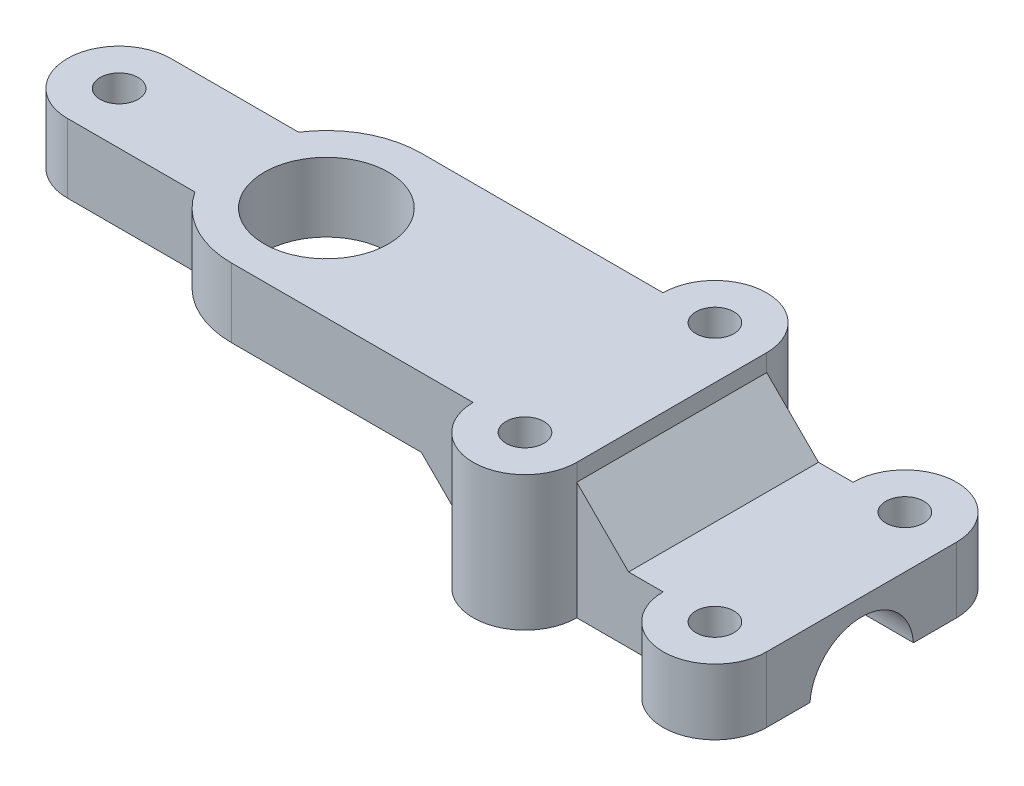
ISO-10303-21;
HEADER;
FILE_DESCRIPTION(('STEP AP214'),'2;1');
FILE_NAME('part.step','',(''),(''),'','','');
FILE_SCHEMA(('AUTOMOTIVE_DESIGN { 1 0 10303 214 1 1 1 1 }'));
ENDSEC;
DATA;
#1=APPLICATION_CONTEXT('core data for automotive mechanical design processes');
#2=APPLICATION_PROTOCOL_DEFINITION('international standard','automotive_design',2000,#1);
#3=PRODUCT_CONTEXT('',#1,'mechanical');
#4=PRODUCT('Part','Part','',(#3));
#5=PRODUCT_RELATED_PRODUCT_CATEGORY('part','',(#4));
#6=PRODUCT_DEFINITION_FORMATION('','',#4);
#7=PRODUCT_DEFINITION_CONTEXT('part definition',#1,'design');
#8=PRODUCT_DEFINITION('design','',#6,#7);
#9=PRODUCT_DEFINITION_SHAPE('','',#8);
#10=(LENGTH_UNIT() NAMED_UNIT(*) SI_UNIT(.MILLI.,.METRE.));
#11=(NAMED_UNIT(*) PLANE_ANGLE_UNIT() SI_UNIT($,.RADIAN.));
#12=(NAMED_UNIT(*) SI_UNIT($,.STERADIAN.) SOLID_ANGLE_UNIT());
#13=UNCERTAINTY_MEASURE_WITH_UNIT(LENGTH_MEASURE(1.E-05),#10,'distance_accuracy_value','');
#14=(GEOMETRIC_REPRESENTATION_CONTEXT(3) GLOBAL_UNCERTAINTY_ASSIGNED_CONTEXT((#13)) GLOBAL_UNIT_ASSIGNED_CONTEXT((#10,
#11,#12)) REPRESENTATION_CONTEXT('',''));
#15=CARTESIAN_POINT('',(0.,0.,0.));
#16=DIRECTION('',(0.,0.,1.));
#17=DIRECTION('',(1.,0.,0.));
#18=AXIS2_PLACEMENT_3D('',#15,#16,#17);
#19=CARTESIAN_POINT('',(26.,-4.,0.));
#20=DIRECTION('',(1.,0.,0.));
#21=DIRECTION('',(0.,0.,-1.));
#22=AXIS2_PLACEMENT_3D('',#19,#20,#21);
#23=PLANE('',#22);
#24=DIRECTION('',(0.,0.,-1.));
#25=VECTOR('',#24,1.);
#26=CARTESIAN_POINT('',(26.,-3.8,-0.974165738677395));
#27=LINE('',#26,#25);
#28=CARTESIAN_POINT('',(26.,-3.8,-1.));
#29=VERTEX_POINT('',#28);
#30=CARTESIAN_POINT('',(26.,-3.8,-5.5));
#31=VERTEX_POINT('',#30);
#32=EDGE_CURVE('E219',#29,#31,#27,.T.);
#33=ORIENTED_EDGE('',*,*,#32,.F.);
#34=DIRECTION('',(0.,-0.707106781186551,-0.707106781186544));
#35=VECTOR('',#34,1.);
#36=CARTESIAN_POINT('',(26.,-3.77416573867739,-0.974165738677395));
#37=LINE('',#36,#35);
#38=CARTESIAN_POINT('',(26.,-3.77416573867739,-0.974165738677395));
#39=VERTEX_POINT('',#38);
#40=EDGE_CURVE('E377',#29,#39,#37,.F.);
#41=ORIENTED_EDGE('',*,*,#40,.T.);
#42=CARTESIAN_POINT('',(26.,-4.,0.));
#43=DIRECTION('',(1.,0.,0.));
#44=DIRECTION('',(0.,0.,-1.));
#45=AXIS2_PLACEMENT_3D('',#42,#43,#44);
#46=CIRCLE('',#45,1.);
#47=CARTESIAN_POINT('',(26.,-3.,0.));
#48=VERTEX_POINT('',#47);
#49=EDGE_CURVE('E414',#39,#48,#46,.T.);
#50=ORIENTED_EDGE('',*,*,#49,.T.);
#51=DIRECTION('',(0.,0.,-1.));
#52=VECTOR('',#51,1.);
#53=CARTESIAN_POINT('',(26.,-3.00000000000001,-5.5));
#54=LINE('',#53,#52);
#55=CARTESIAN_POINT('',(26.,-3.00000000000001,-5.5));
#56=VERTEX_POINT('',#55);
#57=EDGE_CURVE('E243',#48,#56,#54,.T.);
#58=ORIENTED_EDGE('',*,*,#57,.T.);
#59=DIRECTION('',(0.,1.,0.));
#60=VECTOR('',#59,1.);
#61=CARTESIAN_POINT('',(26.,-4.,-5.5));
#62=LINE('',#61,#60);
#63=EDGE_CURVE('E236',#31,#56,#62,.T.);
#64=ORIENTED_EDGE('',*,*,#63,.F.);
#65=EDGE_LOOP('',(#33,#41,#50,#58,#64));
#66=FACE_BOUND('',#65,.T.);
#67=ADVANCED_FACE('F45',(#66),#23,.F.);
#68=CARTESIAN_POINT('',(29.,4.,5.5));
#69=DIRECTION('',(0.,-1.,0.));
#70=DIRECTION('',(0.,0.,-1.));
#71=AXIS2_PLACEMENT_3D('',#68,#69,#70);
#72=CYLINDRICAL_SURFACE('',#71,2.99999999999999);
#73=DIRECTION('',(0.,1.,0.));
#74=VECTOR('',#73,1.);
#75=CARTESIAN_POINT('',(26.,-4.,5.5));
#76=LINE('',#75,#74);
#77=CARTESIAN_POINT('',(26.,-3.8,5.5));
#78=VERTEX_POINT('',#77);
#79=CARTESIAN_POINT('',(26.,-3.00000000000001,5.5));
#80=VERTEX_POINT('',#79);
#81=EDGE_CURVE('E245',#78,#80,#76,.T.);
#82=ORIENTED_EDGE('',*,*,#81,.F.);
#83=CARTESIAN_POINT('',(29.,-3.8,5.5));
#84=DIRECTION('',(0.,-1.,0.));
#85=DIRECTION('',(0.,0.,-1.));
#86=AXIS2_PLACEMENT_3D('',#83,#84,#85);
#87=CIRCLE('',#86,2.99999999999999);
#88=CARTESIAN_POINT('',(32.,-3.8,5.5));
#89=VERTEX_POINT('',#88);
#90=EDGE_CURVE('E230',#89,#78,#87,.T.);
#91=ORIENTED_EDGE('',*,*,#90,.F.);
#92=DIRECTION('',(0.,1.,0.));
#93=VECTOR('',#92,1.);
#94=CARTESIAN_POINT('',(32.,-4.,5.5));
#95=LINE('',#94,#93);
#96=CARTESIAN_POINT('',(32.,2.99999999999998,5.5));
#97=VERTEX_POINT('',#96);
#98=EDGE_CURVE('E247',#89,#97,#95,.T.);
#99=ORIENTED_EDGE('',*,*,#98,.T.);
#100=DIRECTION('',(0.,-1.,0.));
#101=VECTOR('',#100,1.);
#102=CARTESIAN_POINT('',(32.,4.,5.5));
#103=LINE('',#102,#101);
#104=CARTESIAN_POINT('',(32.,4.,5.5));
#105=VERTEX_POINT('',#104);
#106=EDGE_CURVE('E327',#105,#97,#103,.T.);
#107=ORIENTED_EDGE('',*,*,#106,.F.);
#108=CARTESIAN_POINT('',(29.,4.,5.5));
#109=DIRECTION('',(0.,1.,0.));
#110=DIRECTION('',(0.,0.,1.));
#111=AXIS2_PLACEMENT_3D('',#108,#109,#110);
#112=CIRCLE('',#111,2.99999999999999);
#113=CARTESIAN_POINT('',(26.,4.,5.5));
#114=VERTEX_POINT('',#113);
#115=EDGE_CURVE('E279',#105,#114,#112,.F.);
#116=ORIENTED_EDGE('',*,*,#115,.T.);
#117=DIRECTION('',(0.,-1.,0.));
#118=VECTOR('',#117,1.);
#119=CARTESIAN_POINT('',(26.,4.,5.5));
#120=LINE('',#119,#118);
#121=EDGE_CURVE('E330',#114,#80,#120,.T.);
#122=ORIENTED_EDGE('',*,*,#121,.T.);
#123=EDGE_LOOP('',(#82,#91,#99,#107,#116,#122));
#124=FACE_BOUND('',#123,.T.);
#125=ADVANCED_FACE('F512',(#124),#72,.T.);
#126=CARTESIAN_POINT('',(29.,4.,-5.5));
#127=DIRECTION('',(0.,-1.,0.));
#128=DIRECTION('',(0.,0.,-1.));
#129=AXIS2_PLACEMENT_3D('',#126,#127,#128);
#130=CYLINDRICAL_SURFACE('',#129,2.99999999999999);
#131=CARTESIAN_POINT('',(29.,-3.8,-5.5));
#132=DIRECTION('',(0.,-1.,0.));
#133=DIRECTION('',(0.,0.,-1.));
#134=AXIS2_PLACEMENT_3D('',#131,#132,#133);
#135=CIRCLE('',#134,3.);
#136=CARTESIAN_POINT('',(32.,-3.8,-5.5));
#137=VERTEX_POINT('',#136);
#138=EDGE_CURVE('E223',#31,#137,#135,.T.);
#139=ORIENTED_EDGE('',*,*,#138,.F.);
#140=ORIENTED_EDGE('',*,*,#63,.T.);
#141=DIRECTION('',(0.,-1.,0.));
#142=VECTOR('',#141,1.);
#143=CARTESIAN_POINT('',(26.,4.,-5.5));
#144=LINE('',#143,#142);
#145=CARTESIAN_POINT('',(26.,4.,-5.5));
#146=VERTEX_POINT('',#145);
#147=EDGE_CURVE('E323',#146,#56,#144,.T.);
#148=ORIENTED_EDGE('',*,*,#147,.F.);
#149=CARTESIAN_POINT('',(29.,4.,-5.5));
#150=DIRECTION('',(0.,1.,0.));
#151=DIRECTION('',(0.,0.,1.));
#152=AXIS2_PLACEMENT_3D('',#149,#150,#151);
#153=CIRCLE('',#152,2.99999999999999);
#154=CARTESIAN_POINT('',(32.,4.,-5.5));
#155=VERTEX_POINT('',#154);
#156=EDGE_CURVE('E285',#155,#146,#153,.T.);
#157=ORIENTED_EDGE('',*,*,#156,.F.);
#158=DIRECTION('',(0.,-1.,0.));
#159=VECTOR('',#158,1.);
#160=CARTESIAN_POINT('',(32.,4.,-5.5));
#161=LINE('',#160,#159);
#162=CARTESIAN_POINT('',(32.,2.99999999999998,-5.5));
#163=VERTEX_POINT('',#162);
#164=EDGE_CURVE('E325',#155,#163,#161,.T.);
#165=ORIENTED_EDGE('',*,*,#164,.T.);
#166=DIRECTION('',(0.,1.,0.));
#167=VECTOR('',#166,1.);
#168=CARTESIAN_POINT('',(32.,-4.,-5.5));
#169=LINE('',#168,#167);
#170=EDGE_CURVE('E239',#137,#163,#169,.T.);
#171=ORIENTED_EDGE('',*,*,#170,.F.);
#172=EDGE_LOOP('',(#139,#140,#148,#157,#165,#171));
#173=FACE_BOUND('',#172,.T.);
#174=ADVANCED_FACE('F234',(#173),#130,.T.);
#175=CARTESIAN_POINT('',(29.,4.,-5.5));
#176=DIRECTION('',(0.,-1.,0.));
#177=DIRECTION('',(0.,0.,-1.));
#178=AXIS2_PLACEMENT_3D('',#175,#176,#177);
#179=CYLINDRICAL_SURFACE('',#178,1.1);
#180=CARTESIAN_POINT('',(29.,4.,-5.5));
#181=DIRECTION('',(0.,1.,0.));
#182=DIRECTION('',(0.,0.,1.));
#183=AXIS2_PLACEMENT_3D('',#180,#181,#182);
#184=CIRCLE('',#183,1.1);
#185=CARTESIAN_POINT('',(29.,4.,-4.4));
#186=VERTEX_POINT('',#185);
#187=EDGE_CURVE('E262',#186,#186,#184,.T.);
#188=ORIENTED_EDGE('',*,*,#187,.T.);
#189=EDGE_LOOP('',(#188));
#190=FACE_BOUND('',#189,.T.);
#191=CARTESIAN_POINT('',(29.,-3.8,-5.5));
#192=DIRECTION('',(0.,-1.,0.));
#193=DIRECTION('',(0.,0.,-1.));
#194=AXIS2_PLACEMENT_3D('',#191,#192,#193);
#195=CIRCLE('',#194,1.1);
#196=CARTESIAN_POINT('',(29.,-3.8,-6.6));
#197=VERTEX_POINT('',#196);
#198=EDGE_CURVE('E487',#197,#197,#195,.T.);
#199=ORIENTED_EDGE('',*,*,#198,.T.);
#200=EDGE_LOOP('',(#199));
#201=FACE_BOUND('',#200,.T.);
#202=ADVANCED_FACE('F612',(#190,#201),#179,.F.);
#203=CARTESIAN_POINT('',(29.,4.,5.5));
#204=DIRECTION('',(0.,-1.,0.));
#205=DIRECTION('',(0.,0.,-1.));
#206=AXIS2_PLACEMENT_3D('',#203,#204,#205);
#207=CYLINDRICAL_SURFACE('',#206,1.1);
#208=CARTESIAN_POINT('',(29.,4.,5.5));
#209=DIRECTION('',(0.,1.,0.));
#210=DIRECTION('',(0.,0.,1.));
#211=AXIS2_PLACEMENT_3D('',#208,#209,#210);
#212=CIRCLE('',#211,1.1);
#213=CARTESIAN_POINT('',(29.,4.,6.6));
#214=VERTEX_POINT('',#213);
#215=EDGE_CURVE('E259',#214,#214,#212,.F.);
#216=ORIENTED_EDGE('',*,*,#215,.F.);
#217=EDGE_LOOP('',(#216));
#218=FACE_BOUND('',#217,.T.);
#219=CARTESIAN_POINT('',(29.,-3.8,5.5));
#220=DIRECTION('',(0.,-1.,0.));
#221=DIRECTION('',(0.,0.,-1.));
#222=AXIS2_PLACEMENT_3D('',#219,#220,#221);
#223=CIRCLE('',#222,1.1);
#224=CARTESIAN_POINT('',(29.,-3.8,4.4));
#225=VERTEX_POINT('',#224);
#226=EDGE_CURVE('E478',#225,#225,#223,.F.);
#227=ORIENTED_EDGE('',*,*,#226,.F.);
#228=EDGE_LOOP('',(#227));
#229=FACE_BOUND('',#228,.T.);
#230=ADVANCED_FACE('F586',(#218,#229),#207,.F.);
#231=CARTESIAN_POINT('',(43.,-4.,0.));
#232=DIRECTION('',(-1.,0.,0.));
#233=DIRECTION('',(0.,0.,1.));
#234=AXIS2_PLACEMENT_3D('',#231,#232,#233);
#235=PLANE('',#234);
#236=DIRECTION('',(0.,0.,1.));
#237=VECTOR('',#236,1.);
#238=CARTESIAN_POINT('',(43.,-3.8,-5.5));
#239=LINE('',#238,#237);
#240=CARTESIAN_POINT('',(43.,-3.8,-5.5));
#241=VERTEX_POINT('',#240);
#242=CARTESIAN_POINT('',(43.,-3.8,-2.99999999999994));
#243=VERTEX_POINT('',#242);
#244=EDGE_CURVE('E61',#241,#243,#239,.T.);
#245=ORIENTED_EDGE('',*,*,#244,.F.);
#246=DIRECTION('',(0.,1.,0.));
#247=VECTOR('',#246,1.);
#248=CARTESIAN_POINT('',(43.,-4.,-5.5));
#249=LINE('',#248,#247);
#250=CARTESIAN_POINT('',(43.,0.,-5.5));
#251=VERTEX_POINT('',#250);
#252=EDGE_CURVE('E437',#241,#251,#249,.T.);
#253=ORIENTED_EDGE('',*,*,#252,.T.);
#254=DIRECTION('',(0.,0.,1.));
#255=VECTOR('',#254,1.);
#256=CARTESIAN_POINT('',(43.,0.,0.));
#257=LINE('',#256,#255);
#258=CARTESIAN_POINT('',(43.,0.,5.5));
#259=VERTEX_POINT('',#258);
#260=EDGE_CURVE('E407',#251,#259,#257,.T.);
#261=ORIENTED_EDGE('',*,*,#260,.T.);
#262=DIRECTION('',(0.,1.,0.));
#263=VECTOR('',#262,1.);
#264=CARTESIAN_POINT('',(43.,-4.,5.5));
#265=LINE('',#264,#263);
#266=CARTESIAN_POINT('',(43.,-3.8,5.5));
#267=VERTEX_POINT('',#266);
#268=EDGE_CURVE('E256',#267,#259,#265,.T.);
#269=ORIENTED_EDGE('',*,*,#268,.F.);
#270=DIRECTION('',(0.,0.,1.));
#271=VECTOR('',#270,1.);
#272=CARTESIAN_POINT('',(43.,-3.8,3.20000000000005));
#273=LINE('',#272,#271);
#274=CARTESIAN_POINT('',(43.,-3.8,3.00000000000006));
#275=VERTEX_POINT('',#274);
#276=EDGE_CURVE('E468',#275,#267,#273,.T.);
#277=ORIENTED_EDGE('',*,*,#276,.F.);
#278=DIRECTION('',(0.,0.70710678118655,-0.707106781186545));
#279=VECTOR('',#278,1.);
#280=CARTESIAN_POINT('',(43.,-3.79283882771842,2.99283882771847));
#281=LINE('',#280,#279);
#282=CARTESIAN_POINT('',(43.,-3.79283882771841,2.99283882771847));
#283=VERTEX_POINT('',#282);
#284=EDGE_CURVE('E385',#275,#283,#281,.T.);
#285=ORIENTED_EDGE('',*,*,#284,.T.);
#286=CARTESIAN_POINT('',(43.,-4.,0.));
#287=DIRECTION('',(1.,0.,0.));
#288=DIRECTION('',(0.,0.,-1.));
#289=AXIS2_PLACEMENT_3D('',#286,#287,#288);
#290=CIRCLE('',#289,3.);
#291=CARTESIAN_POINT('',(43.,-3.79283882771841,-2.99283882771836));
#292=VERTEX_POINT('',#291);
#293=EDGE_CURVE('E408',#292,#283,#290,.T.);
#294=ORIENTED_EDGE('',*,*,#293,.F.);
#295=DIRECTION('',(0.,0.70710678118655,0.707106781186545));
#296=VECTOR('',#295,1.);
#297=CARTESIAN_POINT('',(43.,-3.79283882771841,-2.99283882771835));
#298=LINE('',#297,#296);
#299=EDGE_CURVE('E387',#292,#243,#298,.F.);
#300=ORIENTED_EDGE('',*,*,#299,.T.);
#301=EDGE_LOOP('',(#245,#253,#261,#269,#277,#285,#294,#300));
#302=FACE_BOUND('',#301,.T.);
#303=ADVANCED_FACE('F456',(#302),#235,.F.);
#304=CARTESIAN_POINT('',(40.,-4.,5.5));
#305=DIRECTION('',(0.,1.,0.));
#306=DIRECTION('',(0.,0.,1.));
#307=AXIS2_PLACEMENT_3D('',#304,#305,#306);
#308=CYLINDRICAL_SURFACE('',#307,3.);
#309=CARTESIAN_POINT('',(40.,-3.8,5.5));
#310=DIRECTION('',(0.,-1.,0.));
#311=DIRECTION('',(0.,0.,-1.));
#312=AXIS2_PLACEMENT_3D('',#309,#310,#311);
#313=CIRCLE('',#312,3.);
#314=CARTESIAN_POINT('',(37.,-3.8,5.5));
#315=VERTEX_POINT('',#314);
#316=EDGE_CURVE('E466',#267,#315,#313,.T.);
#317=ORIENTED_EDGE('',*,*,#316,.F.);
#318=ORIENTED_EDGE('',*,*,#268,.T.);
#319=CARTESIAN_POINT('',(40.,0.,5.5));
#320=DIRECTION('',(0.,-1.,0.));
#321=DIRECTION('',(0.,0.,-1.));
#322=AXIS2_PLACEMENT_3D('',#319,#320,#321);
#323=CIRCLE('',#322,3.);
#324=CARTESIAN_POINT('',(37.,0.,5.5));
#325=VERTEX_POINT('',#324);
#326=EDGE_CURVE('E411',#259,#325,#323,.T.);
#327=ORIENTED_EDGE('',*,*,#326,.T.);
#328=DIRECTION('',(0.,1.,0.));
#329=VECTOR('',#328,1.);
#330=CARTESIAN_POINT('',(37.,-4.,5.5));
#331=LINE('',#330,#329);
#332=EDGE_CURVE('E254',#315,#325,#331,.T.);
#333=ORIENTED_EDGE('',*,*,#332,.F.);
#334=EDGE_LOOP('',(#317,#318,#327,#333));
#335=FACE_BOUND('',#334,.T.);
#336=ADVANCED_FACE('F546',(#335),#308,.T.);
#337=CARTESIAN_POINT('',(0.,-4.,5.5));
#338=DIRECTION('',(0.,0.,1.));
#339=DIRECTION('',(1.,0.,0.));
#340=AXIS2_PLACEMENT_3D('',#337,#338,#339);
#341=PLANE('',#340);
#342=ORIENTED_EDGE('',*,*,#98,.F.);
#343=DIRECTION('',(-1.,0.,0.));
#344=VECTOR('',#343,1.);
#345=CARTESIAN_POINT('',(37.,-3.8,5.5));
#346=LINE('',#345,#344);
#347=EDGE_CURVE('E464',#315,#89,#346,.T.);
#348=ORIENTED_EDGE('',*,*,#347,.F.);
#349=ORIENTED_EDGE('',*,*,#332,.T.);
#350=DIRECTION('',(1.,0.,0.));
#351=VECTOR('',#350,1.);
#352=CARTESIAN_POINT('',(0.,0.,5.5));
#353=LINE('',#352,#351);
#354=CARTESIAN_POINT('',(35.,0.,5.5));
#355=VERTEX_POINT('',#354);
#356=EDGE_CURVE('E422',#355,#325,#353,.T.);
#357=ORIENTED_EDGE('',*,*,#356,.F.);
#358=DIRECTION('',(-0.707106781186552,0.707106781186543,0.));
#359=VECTOR('',#358,1.);
#360=CARTESIAN_POINT('',(35.,0.,5.5));
#361=LINE('',#360,#359);
#362=EDGE_CURVE('E353',#355,#97,#361,.T.);
#363=ORIENTED_EDGE('',*,*,#362,.T.);
#364=EDGE_LOOP('',(#342,#348,#349,#357,#363));
#365=FACE_BOUND('',#364,.T.);
#366=ADVANCED_FACE('F541',(#365),#341,.T.);
#367=DIRECTION('',(0.,0.,-1.));
#368=VECTOR('',#367,1.);
#369=CARTESIAN_POINT('',(26.,-3.8,5.5));
#370=LINE('',#369,#368);
#371=CARTESIAN_POINT('',(26.,-3.8,0.999999999999999));
#372=VERTEX_POINT('',#371);
#373=EDGE_CURVE('E470',#78,#372,#370,.T.);
#374=ORIENTED_EDGE('',*,*,#373,.F.);
#375=ORIENTED_EDGE('',*,*,#81,.T.);
#376=EDGE_CURVE('E348',#80,#48,#54,.T.);
#377=ORIENTED_EDGE('',*,*,#376,.T.);
#378=CARTESIAN_POINT('',(26.,-3.77416573867739,0.974165738677393));
#379=VERTEX_POINT('',#378);
#380=EDGE_CURVE('E417',#48,#379,#46,.T.);
#381=ORIENTED_EDGE('',*,*,#380,.T.);
#382=DIRECTION('',(0.,-0.707106781186551,0.707106781186544));
#383=VECTOR('',#382,1.);
#384=CARTESIAN_POINT('',(26.,-3.77416573867739,0.974165738677393));
#385=LINE('',#384,#383);
#386=EDGE_CURVE('E369',#379,#372,#385,.T.);
#387=ORIENTED_EDGE('',*,*,#386,.T.);
#388=EDGE_LOOP('',(#374,#375,#377,#381,#387));
#389=FACE_BOUND('',#388,.T.);
#390=ADVANCED_FACE('F507',(#389),#23,.F.);
#391=CARTESIAN_POINT('',(0.,-4.,-5.5));
#392=DIRECTION('',(0.,0.,1.));
#393=DIRECTION('',(1.,0.,0.));
#394=AXIS2_PLACEMENT_3D('',#391,#392,#393);
#395=PLANE('',#394);
#396=DIRECTION('',(1.,0.,0.));
#397=VECTOR('',#396,1.);
#398=CARTESIAN_POINT('',(32.,-3.8,-5.5));
#399=LINE('',#398,#397);
#400=CARTESIAN_POINT('',(37.,-3.8,-5.5));
#401=VERTEX_POINT('',#400);
#402=EDGE_CURVE('E240',#137,#401,#399,.T.);
#403=ORIENTED_EDGE('',*,*,#402,.F.);
#404=ORIENTED_EDGE('',*,*,#170,.T.);
#405=DIRECTION('',(0.707106781186552,-0.707106781186543,0.));
#406=VECTOR('',#405,1.);
#407=CARTESIAN_POINT('',(19.4999999999998,15.5,-5.5));
#408=LINE('',#407,#406);
#409=CARTESIAN_POINT('',(35.,0.,-5.5));
#410=VERTEX_POINT('',#409);
#411=EDGE_CURVE('E356',#163,#410,#408,.T.);
#412=ORIENTED_EDGE('',*,*,#411,.T.);
#413=DIRECTION('',(1.,0.,0.));
#414=VECTOR('',#413,1.);
#415=CARTESIAN_POINT('',(0.,0.,-5.5));
#416=LINE('',#415,#414);
#417=CARTESIAN_POINT('',(37.,0.,-5.5));
#418=VERTEX_POINT('',#417);
#419=EDGE_CURVE('E425',#410,#418,#416,.T.);
#420=ORIENTED_EDGE('',*,*,#419,.T.);
#421=DIRECTION('',(0.,1.,0.));
#422=VECTOR('',#421,1.);
#423=CARTESIAN_POINT('',(37.,-4.,-5.5));
#424=LINE('',#423,#422);
#425=EDGE_CURVE('E249',#401,#418,#424,.T.);
#426=ORIENTED_EDGE('',*,*,#425,.F.);
#427=EDGE_LOOP('',(#403,#404,#412,#420,#426));
#428=FACE_BOUND('',#427,.T.);
#429=ADVANCED_FACE('F447',(#428),#395,.F.);
#430=CARTESIAN_POINT('',(40.,-4.,5.5));
#431=DIRECTION('',(0.,1.,0.));
#432=DIRECTION('',(0.,0.,1.));
#433=AXIS2_PLACEMENT_3D('',#430,#431,#432);
#434=CYLINDRICAL_SURFACE('',#433,1.1);
#435=CARTESIAN_POINT('',(40.,0.,5.5));
#436=DIRECTION('',(0.,-1.,0.));
#437=DIRECTION('',(0.,0.,-1.));
#438=AXIS2_PLACEMENT_3D('',#435,#436,#437);
#439=CIRCLE('',#438,1.1);
#440=CARTESIAN_POINT('',(40.,0.,4.4));
#441=VERTEX_POINT('',#440);
#442=EDGE_CURVE('E431',#441,#441,#439,.T.);
#443=ORIENTED_EDGE('',*,*,#442,.F.);
#444=EDGE_LOOP('',(#443));
#445=FACE_BOUND('',#444,.T.);
#446=CARTESIAN_POINT('',(40.,-3.8,5.5));
#447=DIRECTION('',(0.,-1.,0.));
#448=DIRECTION('',(0.,0.,-1.));
#449=AXIS2_PLACEMENT_3D('',#446,#447,#448);
#450=CIRCLE('',#449,1.1);
#451=CARTESIAN_POINT('',(40.,-3.8,4.4));
#452=VERTEX_POINT('',#451);
#453=EDGE_CURVE('E475',#452,#452,#450,.T.);
#454=ORIENTED_EDGE('',*,*,#453,.T.);
#455=EDGE_LOOP('',(#454));
#456=FACE_BOUND('',#455,.T.);
#457=ADVANCED_FACE('F578',(#445,#456),#434,.F.);
#458=CARTESIAN_POINT('',(40.,-4.,-5.5));
#459=DIRECTION('',(0.,1.,0.));
#460=DIRECTION('',(0.,0.,1.));
#461=AXIS2_PLACEMENT_3D('',#458,#459,#460);
#462=CYLINDRICAL_SURFACE('',#461,3.);
#463=ORIENTED_EDGE('',*,*,#252,.F.);
#464=CARTESIAN_POINT('',(40.,-3.8,-5.5));
#465=DIRECTION('',(0.,-1.,0.));
#466=DIRECTION('',(0.,0.,-1.));
#467=AXIS2_PLACEMENT_3D('',#464,#465,#466);
#468=CIRCLE('',#467,3.);
#469=EDGE_CURVE('E444',#401,#241,#468,.T.);
#470=ORIENTED_EDGE('',*,*,#469,.F.);
#471=ORIENTED_EDGE('',*,*,#425,.T.);
#472=CARTESIAN_POINT('',(40.,0.,-5.5));
#473=DIRECTION('',(0.,-1.,0.));
#474=DIRECTION('',(0.,0.,-1.));
#475=AXIS2_PLACEMENT_3D('',#472,#473,#474);
#476=CIRCLE('',#475,3.);
#477=EDGE_CURVE('E428',#251,#418,#476,.F.);
#478=ORIENTED_EDGE('',*,*,#477,.F.);
#479=EDGE_LOOP('',(#463,#470,#471,#478));
#480=FACE_BOUND('',#479,.T.);
#481=ADVANCED_FACE('F443',(#480),#462,.T.);
#482=CARTESIAN_POINT('',(40.,-4.,-5.5));
#483=DIRECTION('',(0.,1.,0.));
#484=DIRECTION('',(0.,0.,1.));
#485=AXIS2_PLACEMENT_3D('',#482,#483,#484);
#486=CYLINDRICAL_SURFACE('',#485,1.1);
#487=CARTESIAN_POINT('',(40.,0.,-5.5));
#488=DIRECTION('',(0.,-1.,0.));
#489=DIRECTION('',(0.,0.,-1.));
#490=AXIS2_PLACEMENT_3D('',#487,#488,#489);
#491=CIRCLE('',#490,1.1);
#492=CARTESIAN_POINT('',(40.,0.,-6.6));
#493=VERTEX_POINT('',#492);
#494=EDGE_CURVE('E434',#493,#493,#491,.F.);
#495=ORIENTED_EDGE('',*,*,#494,.T.);
#496=EDGE_LOOP('',(#495));
#497=FACE_BOUND('',#496,.T.);
#498=CARTESIAN_POINT('',(40.,-3.8,-5.5));
#499=DIRECTION('',(0.,-1.,0.));
#500=DIRECTION('',(0.,0.,-1.));
#501=AXIS2_PLACEMENT_3D('',#498,#499,#500);
#502=CIRCLE('',#501,1.1);
#503=CARTESIAN_POINT('',(40.,-3.8,-6.6));
#504=VERTEX_POINT('',#503);
#505=EDGE_CURVE('E484',#504,#504,#502,.F.);
#506=ORIENTED_EDGE('',*,*,#505,.F.);
#507=EDGE_LOOP('',(#506));
#508=FACE_BOUND('',#507,.T.);
#509=ADVANCED_FACE('F664',(#497,#508),#486,.F.);
#510=CARTESIAN_POINT('',(31.,-4.,0.));
#511=DIRECTION('',(1.,0.,0.));
#512=DIRECTION('',(0.,0.,-1.));
#513=AXIS2_PLACEMENT_3D('',#510,#511,#512);
#514=PLANE('',#513);
#515=DIRECTION('',(0.,0.707106781186551,0.707106781186544));
#516=VECTOR('',#515,1.);
#517=CARTESIAN_POINT('',(31.,-3.39999999999997,-0.599999999999978));
#518=LINE('',#517,#516);
#519=CARTESIAN_POINT('',(31.,-3.77416573867739,-0.974165738677395));
#520=VERTEX_POINT('',#519);
#521=CARTESIAN_POINT('',(31.,-3.8,-1.));
#522=VERTEX_POINT('',#521);
#523=EDGE_CURVE('E372',#520,#522,#518,.F.);
#524=ORIENTED_EDGE('',*,*,#523,.T.);
#525=DIRECTION('',(0.,0.,-1.));
#526=VECTOR('',#525,1.);
#527=CARTESIAN_POINT('',(31.,-3.8,0.));
#528=LINE('',#527,#526);
#529=CARTESIAN_POINT('',(31.,-3.8,-2.99999999999994));
#530=VERTEX_POINT('',#529);
#531=EDGE_CURVE('E481',#522,#530,#528,.T.);
#532=ORIENTED_EDGE('',*,*,#531,.T.);
#533=DIRECTION('',(0.,-0.70710678118655,-0.707106781186545));
#534=VECTOR('',#533,1.);
#535=CARTESIAN_POINT('',(31.,-3.79283882771841,-2.99283882771836));
#536=LINE('',#535,#534);
#537=CARTESIAN_POINT('',(31.,-3.79283882771841,-2.99283882771836));
#538=VERTEX_POINT('',#537);
#539=EDGE_CURVE('E390',#530,#538,#536,.F.);
#540=ORIENTED_EDGE('',*,*,#539,.T.);
#541=CARTESIAN_POINT('',(31.,-4.,0.));
#542=DIRECTION('',(1.,0.,0.));
#543=DIRECTION('',(0.,0.,-1.));
#544=AXIS2_PLACEMENT_3D('',#541,#542,#543);
#545=CIRCLE('',#544,3.);
#546=CARTESIAN_POINT('',(31.,-3.79283882771841,2.99283882771847));
#547=VERTEX_POINT('',#546);
#548=EDGE_CURVE('E402',#538,#547,#545,.T.);
#549=ORIENTED_EDGE('',*,*,#548,.T.);
#550=DIRECTION('',(0.,-0.70710678118655,0.707106781186545));
#551=VECTOR('',#550,1.);
#552=CARTESIAN_POINT('',(31.,-3.79283882771841,2.99283882771847));
#553=LINE('',#552,#551);
#554=CARTESIAN_POINT('',(31.,-3.8,3.00000000000006));
#555=VERTEX_POINT('',#554);
#556=EDGE_CURVE('E392',#547,#555,#553,.T.);
#557=ORIENTED_EDGE('',*,*,#556,.T.);
#558=DIRECTION('',(0.,0.,-1.));
#559=VECTOR('',#558,1.);
#560=CARTESIAN_POINT('',(31.,-3.8,0.));
#561=LINE('',#560,#559);
#562=CARTESIAN_POINT('',(31.,-3.8,1.));
#563=VERTEX_POINT('',#562);
#564=EDGE_CURVE('E68',#555,#563,#561,.T.);
#565=ORIENTED_EDGE('',*,*,#564,.T.);
#566=DIRECTION('',(0.,0.707106781186551,-0.707106781186544));
#567=VECTOR('',#566,1.);
#568=CARTESIAN_POINT('',(31.,-3.40000000000003,0.600000000000032));
#569=LINE('',#568,#567);
#570=CARTESIAN_POINT('',(31.,-3.77416573867739,0.974165738677393));
#571=VERTEX_POINT('',#570);
#572=EDGE_CURVE('E375',#563,#571,#569,.T.);
#573=ORIENTED_EDGE('',*,*,#572,.T.);
#574=CARTESIAN_POINT('',(31.,-4.,0.));
#575=DIRECTION('',(1.,0.,0.));
#576=DIRECTION('',(0.,0.,-1.));
#577=AXIS2_PLACEMENT_3D('',#574,#575,#576);
#578=CIRCLE('',#577,1.);
#579=EDGE_CURVE('E489',#520,#571,#578,.T.);
#580=ORIENTED_EDGE('',*,*,#579,.F.);
#581=EDGE_LOOP('',(#524,#532,#540,#549,#557,#565,#573,#580));
#582=FACE_BOUND('',#581,.T.);
#583=ADVANCED_FACE('F400',(#582),#514,.T.);
#584=CARTESIAN_POINT('',(19.,-3.77416573867739,0.974165738677393));
#585=DIRECTION('',(0.,-0.707106781186544,-0.707106781186551));
#586=DIRECTION('',(1.,0.,0.));
#587=AXIS2_PLACEMENT_3D('',#584,#585,#586);
#588=PLANE('',#587);
#589=ORIENTED_EDGE('',*,*,#572,.F.);
#590=DIRECTION('',(-1.,0.,0.));
#591=VECTOR('',#590,1.);
#592=CARTESIAN_POINT('',(19.,-3.8,1.));
#593=LINE('',#592,#591);
#594=EDGE_CURVE('E459',#563,#372,#593,.T.);
#595=ORIENTED_EDGE('',*,*,#594,.T.);
#596=ORIENTED_EDGE('',*,*,#386,.F.);
#597=DIRECTION('',(1.,0.,0.));
#598=VECTOR('',#597,1.);
#599=CARTESIAN_POINT('',(19.,-3.77416573867739,0.974165738677393));
#600=LINE('',#599,#598);
#601=EDGE_CURVE('E366',#571,#379,#600,.F.);
#602=ORIENTED_EDGE('',*,*,#601,.F.);
#603=EDGE_LOOP('',(#589,#595,#596,#602));
#604=FACE_BOUND('',#603,.T.);
#605=ADVANCED_FACE('F555',(#604),#588,.T.);
#606=CARTESIAN_POINT('',(19.,-3.77416573867739,-0.974165738677395));
#607=DIRECTION('',(0.,0.707106781186544,-0.707106781186551));
#608=DIRECTION('',(1.,0.,0.));
#609=AXIS2_PLACEMENT_3D('',#606,#607,#608);
#610=PLANE('',#609);
#611=ORIENTED_EDGE('',*,*,#40,.F.);
#612=DIRECTION('',(-1.,0.,0.));
#613=VECTOR('',#612,1.);
#614=CARTESIAN_POINT('',(19.,-3.8,-1.));
#615=LINE('',#614,#613);
#616=EDGE_CURVE('E226',#29,#522,#615,.F.);
#617=ORIENTED_EDGE('',*,*,#616,.T.);
#618=ORIENTED_EDGE('',*,*,#523,.F.);
#619=DIRECTION('',(1.,0.,0.));
#620=VECTOR('',#619,1.);
#621=CARTESIAN_POINT('',(19.,-3.77416573867739,-0.974165738677395));
#622=LINE('',#621,#620);
#623=EDGE_CURVE('E363',#39,#520,#622,.T.);
#624=ORIENTED_EDGE('',*,*,#623,.F.);
#625=EDGE_LOOP('',(#611,#617,#618,#624));
#626=FACE_BOUND('',#625,.T.);
#627=ADVANCED_FACE('F553',(#626),#610,.F.);
#628=CARTESIAN_POINT('',(31.,-3.79283882771841,-2.99283882771836));
#629=DIRECTION('',(0.,0.707106781186545,-0.70710678118655));
#630=DIRECTION('',(1.,0.,0.));
#631=AXIS2_PLACEMENT_3D('',#628,#629,#630);
#632=PLANE('',#631);
#633=ORIENTED_EDGE('',*,*,#539,.F.);
#634=DIRECTION('',(-1.,0.,0.));
#635=VECTOR('',#634,1.);
#636=CARTESIAN_POINT('',(31.,-3.8,-2.99999999999994));
#637=LINE('',#636,#635);
#638=EDGE_CURVE('E11',#530,#243,#637,.F.);
#639=ORIENTED_EDGE('',*,*,#638,.T.);
#640=ORIENTED_EDGE('',*,*,#299,.F.);
#641=DIRECTION('',(1.,0.,0.));
#642=VECTOR('',#641,1.);
#643=CARTESIAN_POINT('',(31.,-3.79283882771841,-2.99283882771836));
#644=LINE('',#643,#642);
#645=EDGE_CURVE('E382',#538,#292,#644,.T.);
#646=ORIENTED_EDGE('',*,*,#645,.F.);
#647=EDGE_LOOP('',(#633,#639,#640,#646));
#648=FACE_BOUND('',#647,.T.);
#649=ADVANCED_FACE('F551',(#648),#632,.F.);
#650=CARTESIAN_POINT('',(31.,-3.79283882771841,2.99283882771847));
#651=DIRECTION('',(0.,-0.707106781186545,-0.70710678118655));
#652=DIRECTION('',(1.,0.,0.));
#653=AXIS2_PLACEMENT_3D('',#650,#651,#652);
#654=PLANE('',#653);
#655=ORIENTED_EDGE('',*,*,#284,.F.);
#656=DIRECTION('',(-1.,0.,0.));
#657=VECTOR('',#656,1.);
#658=CARTESIAN_POINT('',(31.,-3.8,3.00000000000006));
#659=LINE('',#658,#657);
#660=EDGE_CURVE('E54',#275,#555,#659,.T.);
#661=ORIENTED_EDGE('',*,*,#660,.T.);
#662=ORIENTED_EDGE('',*,*,#556,.F.);
#663=DIRECTION('',(1.,0.,0.));
#664=VECTOR('',#663,1.);
#665=CARTESIAN_POINT('',(31.,-3.79283882771841,2.99283882771847));
#666=LINE('',#665,#664);
#667=EDGE_CURVE('E379',#283,#547,#666,.F.);
#668=ORIENTED_EDGE('',*,*,#667,.F.);
#669=EDGE_LOOP('',(#655,#661,#662,#668));
#670=FACE_BOUND('',#669,.T.);
#671=ADVANCED_FACE('F48',(#670),#654,.T.);
#672=CARTESIAN_POINT('',(0.,0.,0.));
#673=DIRECTION('',(0.,1.,0.));
#674=DIRECTION('',(0.,0.,1.));
#675=AXIS2_PLACEMENT_3D('',#672,#673,#674);
#676=PLANE('',#675);
#677=CARTESIAN_POINT('',(12.,0.,0.));
#678=DIRECTION('',(0.,1.,0.));
#679=DIRECTION('',(0.,0.,1.));
#680=AXIS2_PLACEMENT_3D('',#677,#678,#679);
#681=CIRCLE('',#680,3.6);
#682=CARTESIAN_POINT('',(12.,0.,3.6));
#683=VERTEX_POINT('',#682);
#684=EDGE_CURVE('E263',#683,#683,#681,.T.);
#685=ORIENTED_EDGE('',*,*,#684,.T.);
#686=EDGE_LOOP('',(#685));
#687=FACE_BOUND('',#686,.T.);
#688=CARTESIAN_POINT('',(0.,0.,0.));
#689=DIRECTION('',(0.,1.,0.));
#690=DIRECTION('',(0.,0.,1.));
#691=AXIS2_PLACEMENT_3D('',#688,#689,#690);
#692=CIRCLE('',#691,1.1);
#693=CARTESIAN_POINT('',(0.,0.,1.1));
#694=VERTEX_POINT('',#693);
#695=EDGE_CURVE('E258',#694,#694,#692,.T.);
#696=ORIENTED_EDGE('',*,*,#695,.T.);
#697=EDGE_LOOP('',(#696));
#698=FACE_BOUND('',#697,.T.);
#699=DIRECTION('',(1.,0.,0.));
#700=VECTOR('',#699,1.);
#701=CARTESIAN_POINT('',(0.,0.,-5.5));
#702=LINE('',#701,#700);
#703=CARTESIAN_POINT('',(12.,0.,-5.5));
#704=VERTEX_POINT('',#703);
#705=CARTESIAN_POINT('',(23.,0.,-5.5));
#706=VERTEX_POINT('',#705);
#707=EDGE_CURVE('E310',#704,#706,#702,.T.);
#708=ORIENTED_EDGE('',*,*,#707,.T.);
#709=DIRECTION('',(0.,0.,1.));
#710=VECTOR('',#709,1.);
#711=CARTESIAN_POINT('',(23.,0.,5.5));
#712=LINE('',#711,#710);
#713=CARTESIAN_POINT('',(23.,0.,5.5));
#714=VERTEX_POINT('',#713);
#715=EDGE_CURVE('E351',#706,#714,#712,.T.);
#716=ORIENTED_EDGE('',*,*,#715,.T.);
#717=DIRECTION('',(1.,0.,0.));
#718=VECTOR('',#717,1.);
#719=CARTESIAN_POINT('',(0.,0.,5.5));
#720=LINE('',#719,#718);
#721=CARTESIAN_POINT('',(12.,0.,5.5));
#722=VERTEX_POINT('',#721);
#723=EDGE_CURVE('E306',#722,#714,#720,.T.);
#724=ORIENTED_EDGE('',*,*,#723,.F.);
#725=CARTESIAN_POINT('',(12.,0.,0.));
#726=DIRECTION('',(0.,1.,0.));
#727=DIRECTION('',(0.,0.,1.));
#728=AXIS2_PLACEMENT_3D('',#725,#726,#727);
#729=CIRCLE('',#728,5.5);
#730=CARTESIAN_POINT('',(7.39022777135356,0.,3.));
#731=VERTEX_POINT('',#730);
#732=EDGE_CURVE('E304',#731,#722,#729,.T.);
#733=ORIENTED_EDGE('',*,*,#732,.F.);
#734=DIRECTION('',(1.,0.,0.));
#735=VECTOR('',#734,1.);
#736=CARTESIAN_POINT('',(0.,0.,3.));
#737=LINE('',#736,#735);
#738=CARTESIAN_POINT('',(0.,0.,3.));
#739=VERTEX_POINT('',#738);
#740=EDGE_CURVE('E302',#739,#731,#737,.T.);
#741=ORIENTED_EDGE('',*,*,#740,.F.);
#742=CARTESIAN_POINT('',(0.,0.,0.));
#743=DIRECTION('',(0.,1.,0.));
#744=DIRECTION('',(0.,0.,1.));
#745=AXIS2_PLACEMENT_3D('',#742,#743,#744);
#746=CIRCLE('',#745,3.);
#747=CARTESIAN_POINT('',(0.,0.,-3.));
#748=VERTEX_POINT('',#747);
#749=EDGE_CURVE('E299',#748,#739,#746,.T.);
#750=ORIENTED_EDGE('',*,*,#749,.F.);
#751=DIRECTION('',(1.,0.,0.));
#752=VECTOR('',#751,1.);
#753=CARTESIAN_POINT('',(0.,0.,-3.));
#754=LINE('',#753,#752);
#755=CARTESIAN_POINT('',(7.39022777135356,0.,-3.));
#756=VERTEX_POINT('',#755);
#757=EDGE_CURVE('E313',#748,#756,#754,.T.);
#758=ORIENTED_EDGE('',*,*,#757,.T.);
#759=EDGE_CURVE('E307',#704,#756,#729,.T.);
#760=ORIENTED_EDGE('',*,*,#759,.F.);
#761=EDGE_LOOP('',(#708,#716,#724,#733,#741,#750,#758,#760));
#762=FACE_BOUND('',#761,.T.);
#763=ADVANCED_FACE('F519',(#687,#698,#762),#676,.F.);
#764=CARTESIAN_POINT('',(0.,4.,0.));
#765=DIRECTION('',(0.,-1.,0.));
#766=DIRECTION('',(0.,0.,-1.));
#767=AXIS2_PLACEMENT_3D('',#764,#765,#766);
#768=CYLINDRICAL_SURFACE('',#767,3.);
#769=ORIENTED_EDGE('',*,*,#749,.T.);
#770=DIRECTION('',(0.,-1.,0.));
#771=VECTOR('',#770,1.);
#772=CARTESIAN_POINT('',(0.,4.,3.));
#773=LINE('',#772,#771);
#774=CARTESIAN_POINT('',(0.,4.,3.));
#775=VERTEX_POINT('',#774);
#776=EDGE_CURVE('E339',#775,#739,#773,.T.);
#777=ORIENTED_EDGE('',*,*,#776,.F.);
#778=CARTESIAN_POINT('',(0.,4.,0.));
#779=DIRECTION('',(0.,1.,0.));
#780=DIRECTION('',(0.,0.,1.));
#781=AXIS2_PLACEMENT_3D('',#778,#779,#780);
#782=CIRCLE('',#781,3.);
#783=CARTESIAN_POINT('',(0.,4.,-3.));
#784=VERTEX_POINT('',#783);
#785=EDGE_CURVE('E269',#784,#775,#782,.T.);
#786=ORIENTED_EDGE('',*,*,#785,.F.);
#787=DIRECTION('',(0.,-1.,0.));
#788=VECTOR('',#787,1.);
#789=CARTESIAN_POINT('',(0.,4.,-3.));
#790=LINE('',#789,#788);
#791=EDGE_CURVE('E296',#784,#748,#790,.T.);
#792=ORIENTED_EDGE('',*,*,#791,.T.);
#793=EDGE_LOOP('',(#769,#777,#786,#792));
#794=FACE_BOUND('',#793,.T.);
#795=ADVANCED_FACE('F593',(#794),#768,.T.);
#796=CARTESIAN_POINT('',(0.,4.,3.));
#797=DIRECTION('',(0.,0.,-1.));
#798=DIRECTION('',(-1.,0.,0.));
#799=AXIS2_PLACEMENT_3D('',#796,#797,#798);
#800=PLANE('',#799);
#801=ORIENTED_EDGE('',*,*,#740,.T.);
#802=DIRECTION('',(0.,-1.,0.));
#803=VECTOR('',#802,1.);
#804=CARTESIAN_POINT('',(7.39022777135356,4.,3.));
#805=LINE('',#804,#803);
#806=CARTESIAN_POINT('',(7.39022777135356,4.,3.));
#807=VERTEX_POINT('',#806);
#808=EDGE_CURVE('E336',#807,#731,#805,.T.);
#809=ORIENTED_EDGE('',*,*,#808,.F.);
#810=DIRECTION('',(1.,0.,0.));
#811=VECTOR('',#810,1.);
#812=CARTESIAN_POINT('',(0.,4.,3.));
#813=LINE('',#812,#811);
#814=EDGE_CURVE('E272',#775,#807,#813,.T.);
#815=ORIENTED_EDGE('',*,*,#814,.F.);
#816=ORIENTED_EDGE('',*,*,#776,.T.);
#817=EDGE_LOOP('',(#801,#809,#815,#816));
#818=FACE_BOUND('',#817,.T.);
#819=ADVANCED_FACE('F617',(#818),#800,.F.);
#820=CARTESIAN_POINT('',(12.,4.,0.));
#821=DIRECTION('',(0.,-1.,0.));
#822=DIRECTION('',(0.,0.,-1.));
#823=AXIS2_PLACEMENT_3D('',#820,#821,#822);
#824=CYLINDRICAL_SURFACE('',#823,5.5);
#825=ORIENTED_EDGE('',*,*,#732,.T.);
#826=DIRECTION('',(0.,-1.,0.));
#827=VECTOR('',#826,1.);
#828=CARTESIAN_POINT('',(12.,4.,5.5));
#829=LINE('',#828,#827);
#830=CARTESIAN_POINT('',(12.,4.,5.5));
#831=VERTEX_POINT('',#830);
#832=EDGE_CURVE('E333',#831,#722,#829,.T.);
#833=ORIENTED_EDGE('',*,*,#832,.F.);
#834=CARTESIAN_POINT('',(12.,4.,0.));
#835=DIRECTION('',(0.,1.,0.));
#836=DIRECTION('',(0.,0.,1.));
#837=AXIS2_PLACEMENT_3D('',#834,#835,#836);
#838=CIRCLE('',#837,5.5);
#839=EDGE_CURVE('E274',#807,#831,#838,.T.);
#840=ORIENTED_EDGE('',*,*,#839,.F.);
#841=ORIENTED_EDGE('',*,*,#808,.T.);
#842=EDGE_LOOP('',(#825,#833,#840,#841));
#843=FACE_BOUND('',#842,.T.);
#844=ADVANCED_FACE('F607',(#843),#824,.T.);
#845=CARTESIAN_POINT('',(0.,4.,5.5));
#846=DIRECTION('',(0.,0.,-1.));
#847=DIRECTION('',(-1.,0.,0.));
#848=AXIS2_PLACEMENT_3D('',#845,#846,#847);
#849=PLANE('',#848);
#850=ORIENTED_EDGE('',*,*,#723,.T.);
#851=DIRECTION('',(-0.707106781186543,0.707106781186552,0.));
#852=VECTOR('',#851,1.);
#853=CARTESIAN_POINT('',(9.50000000000015,13.5,5.5));
#854=LINE('',#853,#852);
#855=EDGE_CURVE('E360',#714,#80,#854,.F.);
#856=ORIENTED_EDGE('',*,*,#855,.T.);
#857=ORIENTED_EDGE('',*,*,#121,.F.);
#858=DIRECTION('',(1.,0.,0.));
#859=VECTOR('',#858,1.);
#860=CARTESIAN_POINT('',(0.,4.,5.5));
#861=LINE('',#860,#859);
#862=EDGE_CURVE('E276',#831,#114,#861,.T.);
#863=ORIENTED_EDGE('',*,*,#862,.F.);
#864=ORIENTED_EDGE('',*,*,#832,.T.);
#865=EDGE_LOOP('',(#850,#856,#857,#863,#864));
#866=FACE_BOUND('',#865,.T.);
#867=ADVANCED_FACE('F516',(#866),#849,.F.);
#868=CARTESIAN_POINT('',(32.,4.,0.));
#869=DIRECTION('',(1.,0.,0.));
#870=DIRECTION('',(0.,0.,-1.));
#871=AXIS2_PLACEMENT_3D('',#868,#869,#870);
#872=PLANE('',#871);
#873=ORIENTED_EDGE('',*,*,#106,.T.);
#874=DIRECTION('',(0.,0.,-1.));
#875=VECTOR('',#874,1.);
#876=CARTESIAN_POINT('',(32.,2.99999999999998,0.));
#877=LINE('',#876,#875);
#878=EDGE_CURVE('E345',#97,#163,#877,.T.);
#879=ORIENTED_EDGE('',*,*,#878,.T.);
#880=ORIENTED_EDGE('',*,*,#164,.F.);
#881=DIRECTION('',(0.,0.,1.));
#882=VECTOR('',#881,1.);
#883=CARTESIAN_POINT('',(32.,4.,0.));
#884=LINE('',#883,#882);
#885=EDGE_CURVE('E282',#155,#105,#884,.T.);
#886=ORIENTED_EDGE('',*,*,#885,.T.);
#887=EDGE_LOOP('',(#873,#879,#880,#886));
#888=FACE_BOUND('',#887,.T.);
#889=ADVANCED_FACE('F534',(#888),#872,.T.);
#890=CARTESIAN_POINT('',(0.,4.,-5.5));
#891=DIRECTION('',(0.,0.,-1.));
#892=DIRECTION('',(-1.,0.,0.));
#893=AXIS2_PLACEMENT_3D('',#890,#891,#892);
#894=PLANE('',#893);
#895=ORIENTED_EDGE('',*,*,#707,.F.);
#896=DIRECTION('',(0.,-1.,0.));
#897=VECTOR('',#896,1.);
#898=CARTESIAN_POINT('',(12.,4.,-5.5));
#899=LINE('',#898,#897);
#900=CARTESIAN_POINT('',(12.,4.,-5.5));
#901=VERTEX_POINT('',#900);
#902=EDGE_CURVE('E321',#901,#704,#899,.T.);
#903=ORIENTED_EDGE('',*,*,#902,.F.);
#904=DIRECTION('',(1.,0.,0.));
#905=VECTOR('',#904,1.);
#906=CARTESIAN_POINT('',(0.,4.,-5.5));
#907=LINE('',#906,#905);
#908=EDGE_CURVE('E287',#901,#146,#907,.T.);
#909=ORIENTED_EDGE('',*,*,#908,.T.);
#910=ORIENTED_EDGE('',*,*,#147,.T.);
#911=DIRECTION('',(0.707106781186543,-0.707106781186552,0.));
#912=VECTOR('',#911,1.);
#913=CARTESIAN_POINT('',(26.,-3.00000000000001,-5.5));
#914=LINE('',#913,#912);
#915=EDGE_CURVE('E358',#56,#706,#914,.F.);
#916=ORIENTED_EDGE('',*,*,#915,.T.);
#917=EDGE_LOOP('',(#895,#903,#909,#910,#916));
#918=FACE_BOUND('',#917,.T.);
#919=ADVANCED_FACE('F525',(#918),#894,.T.);
#920=ORIENTED_EDGE('',*,*,#759,.T.);
#921=DIRECTION('',(0.,-1.,0.));
#922=VECTOR('',#921,1.);
#923=CARTESIAN_POINT('',(7.39022777135356,4.,-3.));
#924=LINE('',#923,#922);
#925=CARTESIAN_POINT('',(7.39022777135356,4.,-3.));
#926=VERTEX_POINT('',#925);
#927=EDGE_CURVE('E319',#926,#756,#924,.T.);
#928=ORIENTED_EDGE('',*,*,#927,.F.);
#929=EDGE_CURVE('E277',#901,#926,#838,.T.);
#930=ORIENTED_EDGE('',*,*,#929,.F.);
#931=ORIENTED_EDGE('',*,*,#902,.T.);
#932=EDGE_LOOP('',(#920,#928,#930,#931));
#933=FACE_BOUND('',#932,.T.);
#934=ADVANCED_FACE('F602',(#933),#824,.T.);
#935=CARTESIAN_POINT('',(0.,4.,-3.));
#936=DIRECTION('',(0.,0.,-1.));
#937=DIRECTION('',(-1.,0.,0.));
#938=AXIS2_PLACEMENT_3D('',#935,#936,#937);
#939=PLANE('',#938);
#940=ORIENTED_EDGE('',*,*,#757,.F.);
#941=ORIENTED_EDGE('',*,*,#791,.F.);
#942=DIRECTION('',(1.,0.,0.));
#943=VECTOR('',#942,1.);
#944=CARTESIAN_POINT('',(0.,4.,-3.));
#945=LINE('',#944,#943);
#946=EDGE_CURVE('E290',#784,#926,#945,.T.);
#947=ORIENTED_EDGE('',*,*,#946,.T.);
#948=ORIENTED_EDGE('',*,*,#927,.T.);
#949=EDGE_LOOP('',(#940,#941,#947,#948));
#950=FACE_BOUND('',#949,.T.);
#951=ADVANCED_FACE('F599',(#950),#939,.T.);
#952=CARTESIAN_POINT('',(0.,4.,0.));
#953=DIRECTION('',(0.,-1.,0.));
#954=DIRECTION('',(0.,0.,-1.));
#955=AXIS2_PLACEMENT_3D('',#952,#953,#954);
#956=CYLINDRICAL_SURFACE('',#955,1.1);
#957=CARTESIAN_POINT('',(0.,4.,0.));
#958=DIRECTION('',(0.,1.,0.));
#959=DIRECTION('',(0.,0.,1.));
#960=AXIS2_PLACEMENT_3D('',#957,#958,#959);
#961=CIRCLE('',#960,1.1);
#962=CARTESIAN_POINT('',(0.,4.,1.1));
#963=VERTEX_POINT('',#962);
#964=EDGE_CURVE('E266',#963,#963,#961,.T.);
#965=ORIENTED_EDGE('',*,*,#964,.T.);
#966=EDGE_LOOP('',(#965));
#967=FACE_BOUND('',#966,.T.);
#968=ORIENTED_EDGE('',*,*,#695,.F.);
#969=EDGE_LOOP('',(#968));
#970=FACE_BOUND('',#969,.T.);
#971=ADVANCED_FACE('F597',(#967,#970),#956,.F.);
#972=CARTESIAN_POINT('',(12.,4.,0.));
#973=DIRECTION('',(0.,-1.,0.));
#974=DIRECTION('',(0.,0.,-1.));
#975=AXIS2_PLACEMENT_3D('',#972,#973,#974);
#976=CYLINDRICAL_SURFACE('',#975,3.6);
#977=CARTESIAN_POINT('',(12.,4.,0.));
#978=DIRECTION('',(0.,1.,0.));
#979=DIRECTION('',(0.,0.,1.));
#980=AXIS2_PLACEMENT_3D('',#977,#978,#979);
#981=CIRCLE('',#980,3.6);
#982=CARTESIAN_POINT('',(12.,4.,3.6));
#983=VERTEX_POINT('',#982);
#984=EDGE_CURVE('E293',#983,#983,#981,.T.);
#985=ORIENTED_EDGE('',*,*,#984,.T.);
#986=EDGE_LOOP('',(#985));
#987=FACE_BOUND('',#986,.T.);
#988=ORIENTED_EDGE('',*,*,#684,.F.);
#989=EDGE_LOOP('',(#988));
#990=FACE_BOUND('',#989,.T.);
#991=ADVANCED_FACE('F589',(#987,#990),#976,.F.);
#992=CARTESIAN_POINT('',(0.,4.,0.));
#993=DIRECTION('',(0.,1.,0.));
#994=DIRECTION('',(0.,0.,1.));
#995=AXIS2_PLACEMENT_3D('',#992,#993,#994);
#996=PLANE('',#995);
#997=ORIENTED_EDGE('',*,*,#215,.T.);
#998=EDGE_LOOP('',(#997));
#999=FACE_BOUND('',#998,.T.);
#1000=ORIENTED_EDGE('',*,*,#187,.F.);
#1001=EDGE_LOOP('',(#1000));
#1002=FACE_BOUND('',#1001,.T.);
#1003=ORIENTED_EDGE('',*,*,#964,.F.);
#1004=EDGE_LOOP('',(#1003));
#1005=FACE_BOUND('',#1004,.T.);
#1006=ORIENTED_EDGE('',*,*,#785,.T.);
#1007=ORIENTED_EDGE('',*,*,#814,.T.);
#1008=ORIENTED_EDGE('',*,*,#839,.T.);
#1009=ORIENTED_EDGE('',*,*,#862,.T.);
#1010=ORIENTED_EDGE('',*,*,#115,.F.);
#1011=ORIENTED_EDGE('',*,*,#885,.F.);
#1012=ORIENTED_EDGE('',*,*,#156,.T.);
#1013=ORIENTED_EDGE('',*,*,#908,.F.);
#1014=ORIENTED_EDGE('',*,*,#929,.T.);
#1015=ORIENTED_EDGE('',*,*,#946,.F.);
#1016=EDGE_LOOP('',(#1006,#1007,#1008,#1009,#1010,#1011,#1012,#1013,#1014,#1015));
#1017=FACE_BOUND('',#1016,.T.);
#1018=ORIENTED_EDGE('',*,*,#984,.F.);
#1019=EDGE_LOOP('',(#1018));
#1020=FACE_BOUND('',#1019,.T.);
#1021=ADVANCED_FACE('F531',(#999,#1002,#1005,#1017,#1020),#996,.T.);
#1022=CARTESIAN_POINT('',(0.,0.,0.));
#1023=DIRECTION('',(0.,-1.,0.));
#1024=DIRECTION('',(0.,0.,-1.));
#1025=AXIS2_PLACEMENT_3D('',#1022,#1023,#1024);
#1026=PLANE('',#1025);
#1027=ORIENTED_EDGE('',*,*,#494,.F.);
#1028=EDGE_LOOP('',(#1027));
#1029=FACE_BOUND('',#1028,.T.);
#1030=ORIENTED_EDGE('',*,*,#442,.T.);
#1031=EDGE_LOOP('',(#1030));
#1032=FACE_BOUND('',#1031,.T.);
#1033=ORIENTED_EDGE('',*,*,#419,.F.);
#1034=DIRECTION('',(0.,0.,1.));
#1035=VECTOR('',#1034,1.);
#1036=CARTESIAN_POINT('',(35.,0.,0.));
#1037=LINE('',#1036,#1035);
#1038=EDGE_CURVE('E342',#410,#355,#1037,.T.);
#1039=ORIENTED_EDGE('',*,*,#1038,.T.);
#1040=ORIENTED_EDGE('',*,*,#356,.T.);
#1041=ORIENTED_EDGE('',*,*,#326,.F.);
#1042=ORIENTED_EDGE('',*,*,#260,.F.);
#1043=ORIENTED_EDGE('',*,*,#477,.T.);
#1044=EDGE_LOOP('',(#1033,#1039,#1040,#1041,#1042,#1043));
#1045=FACE_BOUND('',#1044,.T.);
#1046=ADVANCED_FACE('F452',(#1029,#1032,#1045),#1026,.F.);
#1047=CARTESIAN_POINT('',(35.,0.,0.));
#1048=DIRECTION('',(-0.707106781186543,-0.707106781186552,0.));
#1049=DIRECTION('',(0.,0.,1.));
#1050=AXIS2_PLACEMENT_3D('',#1047,#1048,#1049);
#1051=PLANE('',#1050);
#1052=ORIENTED_EDGE('',*,*,#411,.F.);
#1053=ORIENTED_EDGE('',*,*,#878,.F.);
#1054=ORIENTED_EDGE('',*,*,#362,.F.);
#1055=ORIENTED_EDGE('',*,*,#1038,.F.);
#1056=EDGE_LOOP('',(#1052,#1053,#1054,#1055));
#1057=FACE_BOUND('',#1056,.T.);
#1058=ADVANCED_FACE('F537',(#1057),#1051,.F.);
#1059=CARTESIAN_POINT('',(26.,-3.00000000000001,0.));
#1060=DIRECTION('',(-0.707106781186552,-0.707106781186543,0.));
#1061=DIRECTION('',(0.,0.,1.));
#1062=AXIS2_PLACEMENT_3D('',#1059,#1060,#1061);
#1063=PLANE('',#1062);
#1064=ORIENTED_EDGE('',*,*,#855,.F.);
#1065=ORIENTED_EDGE('',*,*,#715,.F.);
#1066=ORIENTED_EDGE('',*,*,#915,.F.);
#1067=ORIENTED_EDGE('',*,*,#57,.F.);
#1068=ORIENTED_EDGE('',*,*,#376,.F.);
#1069=EDGE_LOOP('',(#1064,#1065,#1066,#1067,#1068));
#1070=FACE_BOUND('',#1069,.T.);
#1071=ADVANCED_FACE('F504',(#1070),#1063,.T.);
#1072=CARTESIAN_POINT('',(31.,-4.,0.));
#1073=DIRECTION('',(1.,0.,0.));
#1074=DIRECTION('',(0.,0.,-1.));
#1075=AXIS2_PLACEMENT_3D('',#1072,#1073,#1074);
#1076=CYLINDRICAL_SURFACE('',#1075,3.);
#1077=ORIENTED_EDGE('',*,*,#548,.F.);
#1078=ORIENTED_EDGE('',*,*,#645,.T.);
#1079=ORIENTED_EDGE('',*,*,#293,.T.);
#1080=ORIENTED_EDGE('',*,*,#667,.T.);
#1081=EDGE_LOOP('',(#1077,#1078,#1079,#1080));
#1082=FACE_BOUND('',#1081,.T.);
#1083=ADVANCED_FACE('F549',(#1082),#1076,.F.);
#1084=CARTESIAN_POINT('',(19.,-4.,0.));
#1085=DIRECTION('',(1.,0.,0.));
#1086=DIRECTION('',(0.,0.,-1.));
#1087=AXIS2_PLACEMENT_3D('',#1084,#1085,#1086);
#1088=CYLINDRICAL_SURFACE('',#1087,1.);
#1089=ORIENTED_EDGE('',*,*,#579,.T.);
#1090=ORIENTED_EDGE('',*,*,#601,.T.);
#1091=ORIENTED_EDGE('',*,*,#380,.F.);
#1092=ORIENTED_EDGE('',*,*,#49,.F.);
#1093=ORIENTED_EDGE('',*,*,#623,.T.);
#1094=EDGE_LOOP('',(#1089,#1090,#1091,#1092,#1093));
#1095=FACE_BOUND('',#1094,.T.);
#1096=ADVANCED_FACE('F499',(#1095),#1088,.F.);
#1097=CARTESIAN_POINT('',(29.,-3.8,5.5));
#1098=DIRECTION('',(0.,-1.,0.));
#1099=DIRECTION('',(0.,0.,-1.));
#1100=AXIS2_PLACEMENT_3D('',#1097,#1098,#1099);
#1101=PLANE('',#1100);
#1102=ORIENTED_EDGE('',*,*,#453,.F.);
#1103=EDGE_LOOP('',(#1102));
#1104=FACE_BOUND('',#1103,.T.);
#1105=ORIENTED_EDGE('',*,*,#594,.F.);
#1106=ORIENTED_EDGE('',*,*,#564,.F.);
#1107=ORIENTED_EDGE('',*,*,#660,.F.);
#1108=ORIENTED_EDGE('',*,*,#276,.T.);
#1109=ORIENTED_EDGE('',*,*,#316,.T.);
#1110=ORIENTED_EDGE('',*,*,#347,.T.);
#1111=ORIENTED_EDGE('',*,*,#90,.T.);
#1112=ORIENTED_EDGE('',*,*,#373,.T.);
#1113=EDGE_LOOP('',(#1105,#1106,#1107,#1108,#1109,#1110,#1111,#1112));
#1114=FACE_BOUND('',#1113,.T.);
#1115=ORIENTED_EDGE('',*,*,#226,.T.);
#1116=EDGE_LOOP('',(#1115));
#1117=FACE_BOUND('',#1116,.T.);
#1118=ADVANCED_FACE('F547',(#1104,#1114,#1117),#1101,.T.);
#1119=CARTESIAN_POINT('',(40.,-3.8,-5.5));
#1120=DIRECTION('',(0.,-1.,0.));
#1121=DIRECTION('',(0.,0.,-1.));
#1122=AXIS2_PLACEMENT_3D('',#1119,#1120,#1121);
#1123=PLANE('',#1122);
#1124=ORIENTED_EDGE('',*,*,#198,.F.);
#1125=EDGE_LOOP('',(#1124));
#1126=FACE_BOUND('',#1125,.T.);
#1127=ORIENTED_EDGE('',*,*,#32,.T.);
#1128=ORIENTED_EDGE('',*,*,#138,.T.);
#1129=ORIENTED_EDGE('',*,*,#402,.T.);
#1130=ORIENTED_EDGE('',*,*,#469,.T.);
#1131=ORIENTED_EDGE('',*,*,#244,.T.);
#1132=ORIENTED_EDGE('',*,*,#638,.F.);
#1133=ORIENTED_EDGE('',*,*,#531,.F.);
#1134=ORIENTED_EDGE('',*,*,#616,.F.);
#1135=EDGE_LOOP('',(#1127,#1128,#1129,#1130,#1131,#1132,#1133,#1134));
#1136=FACE_BOUND('',#1135,.T.);
#1137=ORIENTED_EDGE('',*,*,#505,.T.);
#1138=EDGE_LOOP('',(#1137));
#1139=FACE_BOUND('',#1138,.T.);
#1140=ADVANCED_FACE('F221',(#1126,#1136,#1139),#1123,.T.);
#1141=CLOSED_SHELL('',(#67,#125,#174,#202,#230,#303,#336,#366,#390,#429,#457,#481,#509,#583,
#605,#627,#649,#671,#763,#795,#819,#844,#867,#889,#919,#934,#951,#971,#991,#1021,#1046,#1058,
#1071,#1083,#1096,#1118,#1140));
#1142=MANIFOLD_SOLID_BREP('B2',#1141);
#1143=ADVANCED_BREP_SHAPE_REPRESENTATION('',(#18,#1142),#14);
#1144=SHAPE_DEFINITION_REPRESENTATION(#9,#1143);
ENDSEC;
END-ISO-10303-21;
